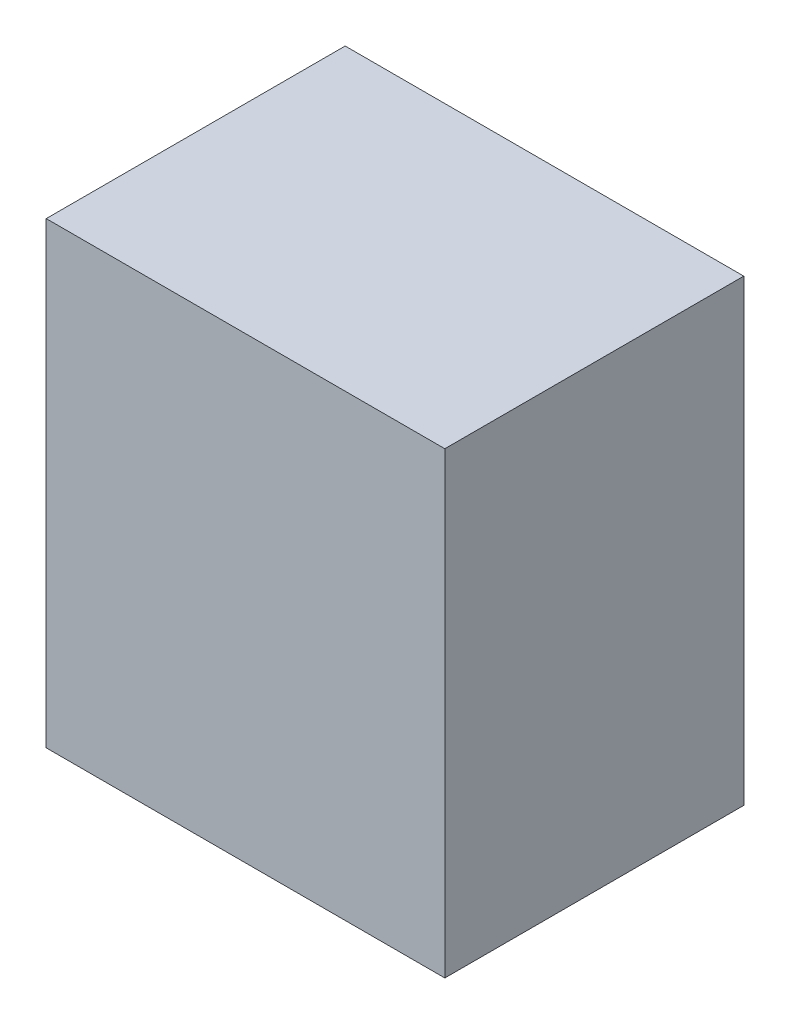
ISO-10303-21;
HEADER;
FILE_DESCRIPTION(('STEP AP214'),'2;1');
FILE_NAME('part.step','',(''),(''),'','','');
FILE_SCHEMA(('AUTOMOTIVE_DESIGN { 1 0 10303 214 1 1 1 1 }'));
ENDSEC;
DATA;
#1=APPLICATION_CONTEXT('core data for automotive mechanical design processes');
#2=APPLICATION_PROTOCOL_DEFINITION('international standard','automotive_design',2000,#1);
#3=PRODUCT_CONTEXT('',#1,'mechanical');
#4=PRODUCT('Part','Part','',(#3));
#5=PRODUCT_RELATED_PRODUCT_CATEGORY('part','',(#4));
#6=PRODUCT_DEFINITION_FORMATION('','',#4);
#7=PRODUCT_DEFINITION_CONTEXT('part definition',#1,'design');
#8=PRODUCT_DEFINITION('design','',#6,#7);
#9=PRODUCT_DEFINITION_SHAPE('','',#8);
#10=(LENGTH_UNIT() NAMED_UNIT(*) SI_UNIT(.MILLI.,.METRE.));
#11=(NAMED_UNIT(*) PLANE_ANGLE_UNIT() SI_UNIT($,.RADIAN.));
#12=(NAMED_UNIT(*) SI_UNIT($,.STERADIAN.) SOLID_ANGLE_UNIT());
#13=UNCERTAINTY_MEASURE_WITH_UNIT(LENGTH_MEASURE(1.E-05),#10,'distance_accuracy_value','');
#14=(GEOMETRIC_REPRESENTATION_CONTEXT(3) GLOBAL_UNCERTAINTY_ASSIGNED_CONTEXT((#13)) GLOBAL_UNIT_ASSIGNED_CONTEXT((#10,
#11,#12)) REPRESENTATION_CONTEXT('',''));
#15=CARTESIAN_POINT('',(0.,0.,0.));
#16=DIRECTION('',(0.,0.,1.));
#17=DIRECTION('',(1.,0.,0.));
#18=AXIS2_PLACEMENT_3D('',#15,#16,#17);
#19=CARTESIAN_POINT('',(10.,23.,-7.5));
#20=DIRECTION('',(-1.,0.,0.));
#21=DIRECTION('',(0.,0.,1.));
#22=AXIS2_PLACEMENT_3D('',#19,#20,#21);
#23=PLANE('',#22);
#24=DIRECTION('',(0.,0.,-1.));
#25=VECTOR('',#24,1.);
#26=CARTESIAN_POINT('',(10.,0.,-7.5));
#27=LINE('',#26,#25);
#28=CARTESIAN_POINT('',(10.,0.,7.5));
#29=VERTEX_POINT('',#28);
#30=CARTESIAN_POINT('',(10.,0.,-7.5));
#31=VERTEX_POINT('',#30);
#32=EDGE_CURVE('E97',#29,#31,#27,.T.);
#33=ORIENTED_EDGE('',*,*,#32,.T.);
#34=DIRECTION('',(0.,-1.,0.));
#35=VECTOR('',#34,1.);
#36=CARTESIAN_POINT('',(10.,23.,-7.5));
#37=LINE('',#36,#35);
#38=CARTESIAN_POINT('',(10.,23.,-7.5));
#39=VERTEX_POINT('',#38);
#40=EDGE_CURVE('E11',#39,#31,#37,.T.);
#41=ORIENTED_EDGE('',*,*,#40,.F.);
#42=DIRECTION('',(0.,0.,-1.));
#43=VECTOR('',#42,1.);
#44=CARTESIAN_POINT('',(10.,23.,-7.5));
#45=LINE('',#44,#43);
#46=CARTESIAN_POINT('',(10.,23.,7.5));
#47=VERTEX_POINT('',#46);
#48=EDGE_CURVE('E85',#47,#39,#45,.T.);
#49=ORIENTED_EDGE('',*,*,#48,.F.);
#50=DIRECTION('',(0.,-1.,0.));
#51=VECTOR('',#50,1.);
#52=CARTESIAN_POINT('',(10.,23.,7.5));
#53=LINE('',#52,#51);
#54=EDGE_CURVE('E93',#47,#29,#53,.T.);
#55=ORIENTED_EDGE('',*,*,#54,.T.);
#56=EDGE_LOOP('',(#33,#41,#49,#55));
#57=FACE_BOUND('',#56,.T.);
#58=ADVANCED_FACE('F34',(#57),#23,.F.);
#59=CARTESIAN_POINT('',(-10.,23.,-7.5));
#60=DIRECTION('',(0.,0.,1.));
#61=DIRECTION('',(1.,0.,0.));
#62=AXIS2_PLACEMENT_3D('',#59,#60,#61);
#63=PLANE('',#62);
#64=DIRECTION('',(-1.,0.,0.));
#65=VECTOR('',#64,1.);
#66=CARTESIAN_POINT('',(-10.,0.,-7.5));
#67=LINE('',#66,#65);
#68=CARTESIAN_POINT('',(-10.,0.,-7.5));
#69=VERTEX_POINT('',#68);
#70=EDGE_CURVE('E89',#31,#69,#67,.T.);
#71=ORIENTED_EDGE('',*,*,#70,.T.);
#72=DIRECTION('',(0.,-1.,0.));
#73=VECTOR('',#72,1.);
#74=CARTESIAN_POINT('',(-10.,23.,-7.5));
#75=LINE('',#74,#73);
#76=CARTESIAN_POINT('',(-10.,23.,-7.5));
#77=VERTEX_POINT('',#76);
#78=EDGE_CURVE('E42',#77,#69,#75,.T.);
#79=ORIENTED_EDGE('',*,*,#78,.F.);
#80=DIRECTION('',(-1.,0.,0.));
#81=VECTOR('',#80,1.);
#82=CARTESIAN_POINT('',(-10.,23.,-7.5));
#83=LINE('',#82,#81);
#84=EDGE_CURVE('E80',#39,#77,#83,.T.);
#85=ORIENTED_EDGE('',*,*,#84,.F.);
#86=ORIENTED_EDGE('',*,*,#40,.T.);
#87=EDGE_LOOP('',(#71,#79,#85,#86));
#88=FACE_BOUND('',#87,.T.);
#89=ADVANCED_FACE('F88',(#88),#63,.F.);
#90=CARTESIAN_POINT('',(-10.,23.,-7.5));
#91=DIRECTION('',(1.,0.,0.));
#92=DIRECTION('',(0.,0.,-1.));
#93=AXIS2_PLACEMENT_3D('',#90,#91,#92);
#94=PLANE('',#93);
#95=DIRECTION('',(0.,0.,1.));
#96=VECTOR('',#95,1.);
#97=CARTESIAN_POINT('',(-10.,0.,-7.5));
#98=LINE('',#97,#96);
#99=CARTESIAN_POINT('',(-10.,0.,7.5));
#100=VERTEX_POINT('',#99);
#101=EDGE_CURVE('E67',#69,#100,#98,.T.);
#102=ORIENTED_EDGE('',*,*,#101,.T.);
#103=DIRECTION('',(0.,-1.,0.));
#104=VECTOR('',#103,1.);
#105=CARTESIAN_POINT('',(-10.,23.,7.5));
#106=LINE('',#105,#104);
#107=CARTESIAN_POINT('',(-10.,23.,7.5));
#108=VERTEX_POINT('',#107);
#109=EDGE_CURVE('E90',#108,#100,#106,.T.);
#110=ORIENTED_EDGE('',*,*,#109,.F.);
#111=DIRECTION('',(0.,0.,1.));
#112=VECTOR('',#111,1.);
#113=CARTESIAN_POINT('',(-10.,23.,-7.5));
#114=LINE('',#113,#112);
#115=EDGE_CURVE('E83',#77,#108,#114,.T.);
#116=ORIENTED_EDGE('',*,*,#115,.F.);
#117=ORIENTED_EDGE('',*,*,#78,.T.);
#118=EDGE_LOOP('',(#102,#110,#116,#117));
#119=FACE_BOUND('',#118,.T.);
#120=ADVANCED_FACE('F91',(#119),#94,.F.);
#121=CARTESIAN_POINT('',(-10.,23.,7.5));
#122=DIRECTION('',(0.,0.,-1.));
#123=DIRECTION('',(-1.,0.,0.));
#124=AXIS2_PLACEMENT_3D('',#121,#122,#123);
#125=PLANE('',#124);
#126=DIRECTION('',(1.,0.,0.));
#127=VECTOR('',#126,1.);
#128=CARTESIAN_POINT('',(-10.,0.,7.5));
#129=LINE('',#128,#127);
#130=EDGE_CURVE('E73',#100,#29,#129,.T.);
#131=ORIENTED_EDGE('',*,*,#130,.T.);
#132=ORIENTED_EDGE('',*,*,#54,.F.);
#133=DIRECTION('',(1.,0.,0.));
#134=VECTOR('',#133,1.);
#135=CARTESIAN_POINT('',(-10.,23.,7.5));
#136=LINE('',#135,#134);
#137=EDGE_CURVE('E50',#108,#47,#136,.T.);
#138=ORIENTED_EDGE('',*,*,#137,.F.);
#139=ORIENTED_EDGE('',*,*,#109,.T.);
#140=EDGE_LOOP('',(#131,#132,#138,#139));
#141=FACE_BOUND('',#140,.T.);
#142=ADVANCED_FACE('F104',(#141),#125,.F.);
#143=CARTESIAN_POINT('',(0.,23.,0.));
#144=DIRECTION('',(0.,1.,0.));
#145=DIRECTION('',(0.,0.,1.));
#146=AXIS2_PLACEMENT_3D('',#143,#144,#145);
#147=PLANE('',#146);
#148=ORIENTED_EDGE('',*,*,#48,.T.);
#149=ORIENTED_EDGE('',*,*,#84,.T.);
#150=ORIENTED_EDGE('',*,*,#115,.T.);
#151=ORIENTED_EDGE('',*,*,#137,.T.);
#152=EDGE_LOOP('',(#148,#149,#150,#151));
#153=FACE_BOUND('',#152,.T.);
#154=ADVANCED_FACE('F81',(#153),#147,.T.);
#155=CARTESIAN_POINT('',(0.,0.,0.));
#156=DIRECTION('',(0.,1.,0.));
#157=DIRECTION('',(0.,0.,1.));
#158=AXIS2_PLACEMENT_3D('',#155,#156,#157);
#159=PLANE('',#158);
#160=ORIENTED_EDGE('',*,*,#32,.F.);
#161=ORIENTED_EDGE('',*,*,#130,.F.);
#162=ORIENTED_EDGE('',*,*,#101,.F.);
#163=ORIENTED_EDGE('',*,*,#70,.F.);
#164=EDGE_LOOP('',(#160,#161,#162,#163));
#165=FACE_BOUND('',#164,.T.);
#166=ADVANCED_FACE('F107',(#165),#159,.F.);
#167=CLOSED_SHELL('',(#58,#89,#120,#142,#154,#166));
#168=MANIFOLD_SOLID_BREP('B2',#167);
#169=ADVANCED_BREP_SHAPE_REPRESENTATION('',(#18,#168),#14);
#170=SHAPE_DEFINITION_REPRESENTATION(#9,#169);
ENDSEC;
END-ISO-10303-21;
